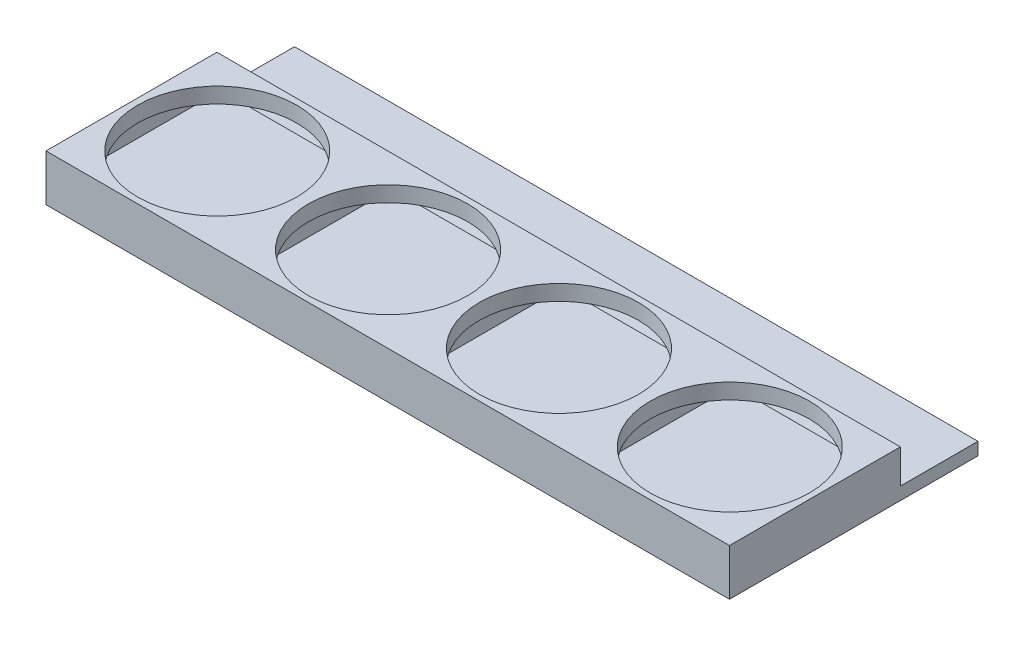
ISO-10303-21;
HEADER;
FILE_DESCRIPTION(('STEP AP214'),'2;1');
FILE_NAME('part.step','',(''),(''),'','','');
FILE_SCHEMA(('AUTOMOTIVE_DESIGN { 1 0 10303 214 1 1 1 1 }'));
ENDSEC;
DATA;
#1=APPLICATION_CONTEXT('core data for automotive mechanical design processes');
#2=APPLICATION_PROTOCOL_DEFINITION('international standard','automotive_design',2000,#1);
#3=PRODUCT_CONTEXT('',#1,'mechanical');
#4=PRODUCT('Part','Part','',(#3));
#5=PRODUCT_RELATED_PRODUCT_CATEGORY('part','',(#4));
#6=PRODUCT_DEFINITION_FORMATION('','',#4);
#7=PRODUCT_DEFINITION_CONTEXT('part definition',#1,'design');
#8=PRODUCT_DEFINITION('design','',#6,#7);
#9=PRODUCT_DEFINITION_SHAPE('','',#8);
#10=(LENGTH_UNIT() NAMED_UNIT(*) SI_UNIT(.MILLI.,.METRE.));
#11=(NAMED_UNIT(*) PLANE_ANGLE_UNIT() SI_UNIT($,.RADIAN.));
#12=(NAMED_UNIT(*) SI_UNIT($,.STERADIAN.) SOLID_ANGLE_UNIT());
#13=UNCERTAINTY_MEASURE_WITH_UNIT(LENGTH_MEASURE(1.E-05),#10,'distance_accuracy_value','');
#14=(GEOMETRIC_REPRESENTATION_CONTEXT(3) GLOBAL_UNCERTAINTY_ASSIGNED_CONTEXT((#13)) GLOBAL_UNIT_ASSIGNED_CONTEXT((#10,
#11,#12)) REPRESENTATION_CONTEXT('',''));
#15=CARTESIAN_POINT('',(0.,0.,0.));
#16=DIRECTION('',(0.,0.,1.));
#17=DIRECTION('',(1.,0.,0.));
#18=AXIS2_PLACEMENT_3D('',#15,#16,#17);
#19=CARTESIAN_POINT('',(0.,-6.,0.));
#20=DIRECTION('',(-1.,0.,0.));
#21=DIRECTION('',(0.,0.,1.));
#22=AXIS2_PLACEMENT_3D('',#19,#20,#21);
#23=PLANE('',#22);
#24=DIRECTION('',(0.,0.,1.));
#25=VECTOR('',#24,1.);
#26=CARTESIAN_POINT('',(0.,0.,0.));
#27=LINE('',#26,#25);
#28=CARTESIAN_POINT('',(0.,0.,-22.));
#29=VERTEX_POINT('',#28);
#30=CARTESIAN_POINT('',(0.,0.,0.));
#31=VERTEX_POINT('',#30);
#32=EDGE_CURVE('E372',#29,#31,#27,.T.);
#33=ORIENTED_EDGE('',*,*,#32,.F.);
#34=DIRECTION('',(0.,1.,0.));
#35=VECTOR('',#34,1.);
#36=CARTESIAN_POINT('',(0.,-6.,-22.));
#37=LINE('',#36,#35);
#38=CARTESIAN_POINT('',(0.,-4.37930067823277,-22.));
#39=VERTEX_POINT('',#38);
#40=EDGE_CURVE('E11',#39,#29,#37,.T.);
#41=ORIENTED_EDGE('',*,*,#40,.F.);
#42=DIRECTION('',(0.,0.,1.));
#43=VECTOR('',#42,1.);
#44=CARTESIAN_POINT('',(0.,-4.37930067823277,-27.));
#45=LINE('',#44,#43);
#46=CARTESIAN_POINT('',(0.,-4.37930067823277,-32.));
#47=VERTEX_POINT('',#46);
#48=EDGE_CURVE('E190',#47,#39,#45,.T.);
#49=ORIENTED_EDGE('',*,*,#48,.F.);
#50=DIRECTION('',(0.,1.,0.));
#51=VECTOR('',#50,1.);
#52=CARTESIAN_POINT('',(0.,-4.37930067823277,-32.));
#53=LINE('',#52,#51);
#54=CARTESIAN_POINT('',(0.,-6.,-32.));
#55=VERTEX_POINT('',#54);
#56=EDGE_CURVE('E205',#55,#47,#53,.T.);
#57=ORIENTED_EDGE('',*,*,#56,.F.);
#58=DIRECTION('',(0.,0.,1.));
#59=VECTOR('',#58,1.);
#60=CARTESIAN_POINT('',(0.,-6.,0.));
#61=LINE('',#60,#59);
#62=CARTESIAN_POINT('',(0.,-6.,0.));
#63=VERTEX_POINT('',#62);
#64=EDGE_CURVE('E373',#55,#63,#61,.T.);
#65=ORIENTED_EDGE('',*,*,#64,.T.);
#66=DIRECTION('',(0.,1.,0.));
#67=VECTOR('',#66,1.);
#68=CARTESIAN_POINT('',(0.,-6.,0.));
#69=LINE('',#68,#67);
#70=EDGE_CURVE('E38',#63,#31,#69,.T.);
#71=ORIENTED_EDGE('',*,*,#70,.T.);
#72=EDGE_LOOP('',(#33,#41,#49,#57,#65,#71));
#73=FACE_BOUND('',#72,.T.);
#74=ADVANCED_FACE('F35',(#73),#23,.T.);
#75=CARTESIAN_POINT('',(0.,-6.,-22.));
#76=DIRECTION('',(0.,0.,-1.));
#77=DIRECTION('',(-1.,0.,0.));
#78=AXIS2_PLACEMENT_3D('',#75,#76,#77);
#79=PLANE('',#78);
#80=DIRECTION('',(1.,0.,0.));
#81=VECTOR('',#80,1.);
#82=CARTESIAN_POINT('',(88.,-4.37930067823277,-22.));
#83=LINE('',#82,#81);
#84=CARTESIAN_POINT('',(88.,-4.37930067823277,-22.));
#85=VERTEX_POINT('',#84);
#86=EDGE_CURVE('E48',#39,#85,#83,.T.);
#87=ORIENTED_EDGE('',*,*,#86,.F.);
#88=ORIENTED_EDGE('',*,*,#40,.T.);
#89=DIRECTION('',(-1.,0.,0.));
#90=VECTOR('',#89,1.);
#91=CARTESIAN_POINT('',(0.,0.,-22.));
#92=LINE('',#91,#90);
#93=CARTESIAN_POINT('',(88.,0.,-22.));
#94=VERTEX_POINT('',#93);
#95=EDGE_CURVE('E377',#94,#29,#92,.T.);
#96=ORIENTED_EDGE('',*,*,#95,.F.);
#97=DIRECTION('',(0.,1.,0.));
#98=VECTOR('',#97,1.);
#99=CARTESIAN_POINT('',(88.,-6.,-22.));
#100=LINE('',#99,#98);
#101=EDGE_CURVE('E330',#85,#94,#100,.T.);
#102=ORIENTED_EDGE('',*,*,#101,.F.);
#103=EDGE_LOOP('',(#87,#88,#96,#102));
#104=FACE_BOUND('',#103,.T.);
#105=DIRECTION('',(0.,-1.,0.));
#106=VECTOR('',#105,1.);
#107=CARTESIAN_POINT('',(43.5,-2.,-22.));
#108=LINE('',#107,#106);
#109=CARTESIAN_POINT('',(43.5,-2.,-22.));
#110=VERTEX_POINT('',#109);
#111=CARTESIAN_POINT('',(43.5,-4.,-22.));
#112=VERTEX_POINT('',#111);
#113=EDGE_CURVE('E56',#110,#112,#108,.T.);
#114=ORIENTED_EDGE('',*,*,#113,.F.);
#115=DIRECTION('',(1.,0.,0.));
#116=VECTOR('',#115,1.);
#117=CARTESIAN_POINT('',(43.5,-2.,-22.));
#118=LINE('',#117,#116);
#119=CARTESIAN_POINT('',(22.5,-2.,-22.));
#120=VERTEX_POINT('',#119);
#121=EDGE_CURVE('E218',#120,#110,#118,.T.);
#122=ORIENTED_EDGE('',*,*,#121,.F.);
#123=DIRECTION('',(0.,1.,0.));
#124=VECTOR('',#123,1.);
#125=CARTESIAN_POINT('',(22.5,-2.,-22.));
#126=LINE('',#125,#124);
#127=CARTESIAN_POINT('',(22.5,-4.,-22.));
#128=VERTEX_POINT('',#127);
#129=EDGE_CURVE('E233',#128,#120,#126,.T.);
#130=ORIENTED_EDGE('',*,*,#129,.F.);
#131=DIRECTION('',(-1.,0.,0.));
#132=VECTOR('',#131,1.);
#133=CARTESIAN_POINT('',(43.5,-4.,-22.));
#134=LINE('',#133,#132);
#135=EDGE_CURVE('E229',#112,#128,#134,.T.);
#136=ORIENTED_EDGE('',*,*,#135,.F.);
#137=EDGE_LOOP('',(#114,#122,#130,#136));
#138=FACE_BOUND('',#137,.T.);
#139=DIRECTION('',(0.,-1.,0.));
#140=VECTOR('',#139,1.);
#141=CARTESIAN_POINT('',(65.5,-2.,-22.));
#142=LINE('',#141,#140);
#143=CARTESIAN_POINT('',(65.5,-2.,-22.));
#144=VERTEX_POINT('',#143);
#145=CARTESIAN_POINT('',(65.5,-4.,-22.));
#146=VERTEX_POINT('',#145);
#147=EDGE_CURVE('E260',#144,#146,#142,.T.);
#148=ORIENTED_EDGE('',*,*,#147,.F.);
#149=DIRECTION('',(1.,0.,0.));
#150=VECTOR('',#149,1.);
#151=CARTESIAN_POINT('',(65.5,-2.,-22.));
#152=LINE('',#151,#150);
#153=CARTESIAN_POINT('',(44.5,-2.,-22.));
#154=VERTEX_POINT('',#153);
#155=EDGE_CURVE('E250',#154,#144,#152,.T.);
#156=ORIENTED_EDGE('',*,*,#155,.F.);
#157=DIRECTION('',(0.,1.,0.));
#158=VECTOR('',#157,1.);
#159=CARTESIAN_POINT('',(44.5,-2.,-22.));
#160=LINE('',#159,#158);
#161=CARTESIAN_POINT('',(44.5,-4.,-22.));
#162=VERTEX_POINT('',#161);
#163=EDGE_CURVE('E266',#162,#154,#160,.T.);
#164=ORIENTED_EDGE('',*,*,#163,.F.);
#165=DIRECTION('',(-1.,0.,0.));
#166=VECTOR('',#165,1.);
#167=CARTESIAN_POINT('',(65.5,-4.,-22.));
#168=LINE('',#167,#166);
#169=EDGE_CURVE('E262',#146,#162,#168,.T.);
#170=ORIENTED_EDGE('',*,*,#169,.F.);
#171=EDGE_LOOP('',(#148,#156,#164,#170));
#172=FACE_BOUND('',#171,.T.);
#173=DIRECTION('',(0.,-1.,0.));
#174=VECTOR('',#173,1.);
#175=CARTESIAN_POINT('',(87.5,-2.,-22.));
#176=LINE('',#175,#174);
#177=CARTESIAN_POINT('',(87.5,-2.,-22.));
#178=VERTEX_POINT('',#177);
#179=CARTESIAN_POINT('',(87.5,-4.,-22.));
#180=VERTEX_POINT('',#179);
#181=EDGE_CURVE('E213',#178,#180,#176,.T.);
#182=ORIENTED_EDGE('',*,*,#181,.F.);
#183=DIRECTION('',(1.,0.,0.));
#184=VECTOR('',#183,1.);
#185=CARTESIAN_POINT('',(87.5,-2.,-22.));
#186=LINE('',#185,#184);
#187=CARTESIAN_POINT('',(66.5,-2.,-22.));
#188=VERTEX_POINT('',#187);
#189=EDGE_CURVE('E282',#188,#178,#186,.T.);
#190=ORIENTED_EDGE('',*,*,#189,.F.);
#191=DIRECTION('',(0.,1.,0.));
#192=VECTOR('',#191,1.);
#193=CARTESIAN_POINT('',(66.5,-2.,-22.));
#194=LINE('',#193,#192);
#195=CARTESIAN_POINT('',(66.5,-4.,-22.));
#196=VERTEX_POINT('',#195);
#197=EDGE_CURVE('E296',#196,#188,#194,.T.);
#198=ORIENTED_EDGE('',*,*,#197,.F.);
#199=DIRECTION('',(-1.,0.,0.));
#200=VECTOR('',#199,1.);
#201=CARTESIAN_POINT('',(87.5,-4.,-22.));
#202=LINE('',#201,#200);
#203=EDGE_CURVE('E293',#180,#196,#202,.T.);
#204=ORIENTED_EDGE('',*,*,#203,.F.);
#205=EDGE_LOOP('',(#182,#190,#198,#204));
#206=FACE_BOUND('',#205,.T.);
#207=DIRECTION('',(0.,-1.,0.));
#208=VECTOR('',#207,1.);
#209=CARTESIAN_POINT('',(21.5,-2.,-22.));
#210=LINE('',#209,#208);
#211=CARTESIAN_POINT('',(21.5,-2.,-22.));
#212=VERTEX_POINT('',#211);
#213=CARTESIAN_POINT('',(21.5,-4.,-22.));
#214=VERTEX_POINT('',#213);
#215=EDGE_CURVE('E332',#212,#214,#210,.T.);
#216=ORIENTED_EDGE('',*,*,#215,.F.);
#217=DIRECTION('',(1.,0.,0.));
#218=VECTOR('',#217,1.);
#219=CARTESIAN_POINT('',(21.5,-2.,-22.));
#220=LINE('',#219,#218);
#221=CARTESIAN_POINT('',(0.499999999999997,-2.,-22.));
#222=VERTEX_POINT('',#221);
#223=EDGE_CURVE('E339',#222,#212,#220,.T.);
#224=ORIENTED_EDGE('',*,*,#223,.F.);
#225=DIRECTION('',(0.,1.,0.));
#226=VECTOR('',#225,1.);
#227=CARTESIAN_POINT('',(0.499999999999997,-2.,-22.));
#228=LINE('',#227,#226);
#229=CARTESIAN_POINT('',(0.499999999999997,-4.,-22.));
#230=VERTEX_POINT('',#229);
#231=EDGE_CURVE('E353',#230,#222,#228,.T.);
#232=ORIENTED_EDGE('',*,*,#231,.F.);
#233=DIRECTION('',(-1.,0.,0.));
#234=VECTOR('',#233,1.);
#235=CARTESIAN_POINT('',(21.5,-4.,-22.));
#236=LINE('',#235,#234);
#237=EDGE_CURVE('E350',#214,#230,#236,.T.);
#238=ORIENTED_EDGE('',*,*,#237,.F.);
#239=EDGE_LOOP('',(#216,#224,#232,#238));
#240=FACE_BOUND('',#239,.T.);
#241=ADVANCED_FACE('F388',(#104,#138,#172,#206,#240),#79,.T.);
#242=CARTESIAN_POINT('',(0.,-6.,0.));
#243=DIRECTION('',(0.,0.,1.));
#244=DIRECTION('',(1.,0.,0.));
#245=AXIS2_PLACEMENT_3D('',#242,#243,#244);
#246=PLANE('',#245);
#247=DIRECTION('',(1.,0.,0.));
#248=VECTOR('',#247,1.);
#249=CARTESIAN_POINT('',(0.,0.,0.));
#250=LINE('',#249,#248);
#251=CARTESIAN_POINT('',(88.,0.,0.));
#252=VERTEX_POINT('',#251);
#253=EDGE_CURVE('E381',#31,#252,#250,.T.);
#254=ORIENTED_EDGE('',*,*,#253,.F.);
#255=ORIENTED_EDGE('',*,*,#70,.F.);
#256=DIRECTION('',(1.,0.,0.));
#257=VECTOR('',#256,1.);
#258=CARTESIAN_POINT('',(0.,-6.,0.));
#259=LINE('',#258,#257);
#260=CARTESIAN_POINT('',(88.,-6.,0.));
#261=VERTEX_POINT('',#260);
#262=EDGE_CURVE('E376',#63,#261,#259,.T.);
#263=ORIENTED_EDGE('',*,*,#262,.T.);
#264=DIRECTION('',(0.,1.,0.));
#265=VECTOR('',#264,1.);
#266=CARTESIAN_POINT('',(88.,-6.,0.));
#267=LINE('',#266,#265);
#268=EDGE_CURVE('E327',#261,#252,#267,.T.);
#269=ORIENTED_EDGE('',*,*,#268,.T.);
#270=EDGE_LOOP('',(#254,#255,#263,#269));
#271=FACE_BOUND('',#270,.T.);
#272=ADVANCED_FACE('F394',(#271),#246,.T.);
#273=CARTESIAN_POINT('',(0.,-6.,0.));
#274=DIRECTION('',(0.,-1.,0.));
#275=DIRECTION('',(0.,0.,-1.));
#276=AXIS2_PLACEMENT_3D('',#273,#274,#275);
#277=PLANE('',#276);
#278=ORIENTED_EDGE('',*,*,#64,.F.);
#279=DIRECTION('',(-1.,0.,0.));
#280=VECTOR('',#279,1.);
#281=CARTESIAN_POINT('',(88.,-6.,-32.));
#282=LINE('',#281,#280);
#283=CARTESIAN_POINT('',(88.,-6.,-32.));
#284=VERTEX_POINT('',#283);
#285=EDGE_CURVE('E207',#284,#55,#282,.T.);
#286=ORIENTED_EDGE('',*,*,#285,.F.);
#287=DIRECTION('',(0.,0.,-1.));
#288=VECTOR('',#287,1.);
#289=CARTESIAN_POINT('',(88.,-6.,0.));
#290=LINE('',#289,#288);
#291=EDGE_CURVE('E198',#261,#284,#290,.T.);
#292=ORIENTED_EDGE('',*,*,#291,.F.);
#293=ORIENTED_EDGE('',*,*,#262,.F.);
#294=EDGE_LOOP('',(#278,#286,#292,#293));
#295=FACE_BOUND('',#294,.T.);
#296=ADVANCED_FACE('F396',(#295),#277,.T.);
#297=CARTESIAN_POINT('',(0.,0.,0.));
#298=DIRECTION('',(0.,-1.,0.));
#299=DIRECTION('',(0.,0.,-1.));
#300=AXIS2_PLACEMENT_3D('',#297,#298,#299);
#301=PLANE('',#300);
#302=CARTESIAN_POINT('',(33.0440730910435,0.,-11.));
#303=DIRECTION('',(0.,1.,0.));
#304=DIRECTION('',(0.,0.,1.));
#305=AXIS2_PLACEMENT_3D('',#302,#303,#304);
#306=CIRCLE('',#305,10.25);
#307=CARTESIAN_POINT('',(33.0440730910435,0.,-0.750000000000006));
#308=VERTEX_POINT('',#307);
#309=EDGE_CURVE('E313',#308,#308,#306,.T.);
#310=ORIENTED_EDGE('',*,*,#309,.F.);
#311=EDGE_LOOP('',(#310));
#312=FACE_BOUND('',#311,.T.);
#313=CARTESIAN_POINT('',(55.0440730910435,0.,-11.));
#314=DIRECTION('',(0.,1.,0.));
#315=DIRECTION('',(0.,0.,1.));
#316=AXIS2_PLACEMENT_3D('',#313,#314,#315);
#317=CIRCLE('',#316,10.25);
#318=CARTESIAN_POINT('',(55.0440730910435,0.,-0.750000000000013));
#319=VERTEX_POINT('',#318);
#320=EDGE_CURVE('E317',#319,#319,#317,.T.);
#321=ORIENTED_EDGE('',*,*,#320,.F.);
#322=EDGE_LOOP('',(#321));
#323=FACE_BOUND('',#322,.T.);
#324=CARTESIAN_POINT('',(77.0440730910435,0.,-11.));
#325=DIRECTION('',(0.,1.,0.));
#326=DIRECTION('',(0.,0.,1.));
#327=AXIS2_PLACEMENT_3D('',#324,#325,#326);
#328=CIRCLE('',#327,10.25);
#329=CARTESIAN_POINT('',(77.0440730910435,0.,-0.75000000000002));
#330=VERTEX_POINT('',#329);
#331=EDGE_CURVE('E311',#330,#330,#328,.T.);
#332=ORIENTED_EDGE('',*,*,#331,.F.);
#333=EDGE_LOOP('',(#332));
#334=FACE_BOUND('',#333,.T.);
#335=CARTESIAN_POINT('',(11.0440730910435,0.,-11.));
#336=DIRECTION('',(0.,1.,0.));
#337=DIRECTION('',(0.,0.,1.));
#338=AXIS2_PLACEMENT_3D('',#335,#336,#337);
#339=CIRCLE('',#338,10.25);
#340=CARTESIAN_POINT('',(11.0440730910435,0.,-0.749999999999999));
#341=VERTEX_POINT('',#340);
#342=EDGE_CURVE('E369',#341,#341,#339,.T.);
#343=ORIENTED_EDGE('',*,*,#342,.F.);
#344=EDGE_LOOP('',(#343));
#345=FACE_BOUND('',#344,.T.);
#346=ORIENTED_EDGE('',*,*,#32,.T.);
#347=ORIENTED_EDGE('',*,*,#253,.T.);
#348=DIRECTION('',(0.,0.,-1.));
#349=VECTOR('',#348,1.);
#350=CARTESIAN_POINT('',(88.,0.,0.));
#351=LINE('',#350,#349);
#352=EDGE_CURVE('E316',#252,#94,#351,.T.);
#353=ORIENTED_EDGE('',*,*,#352,.T.);
#354=ORIENTED_EDGE('',*,*,#95,.T.);
#355=EDGE_LOOP('',(#346,#347,#353,#354));
#356=FACE_BOUND('',#355,.T.);
#357=ADVANCED_FACE('F386',(#312,#323,#334,#345,#356),#301,.F.);
#358=CARTESIAN_POINT('',(11.0440730910435,-2.,-11.));
#359=DIRECTION('',(0.,1.,0.));
#360=DIRECTION('',(0.,0.,1.));
#361=AXIS2_PLACEMENT_3D('',#358,#359,#360);
#362=CYLINDRICAL_SURFACE('',#361,10.25);
#363=CARTESIAN_POINT('',(11.0440730910435,-2.,-11.));
#364=DIRECTION('',(0.,1.,0.));
#365=DIRECTION('',(0.,0.,1.));
#366=AXIS2_PLACEMENT_3D('',#363,#364,#365);
#367=CIRCLE('',#366,10.25);
#368=CARTESIAN_POINT('',(11.0440730910435,-2.,-0.749999999999999));
#369=VERTEX_POINT('',#368);
#370=EDGE_CURVE('E360',#369,#369,#367,.T.);
#371=ORIENTED_EDGE('',*,*,#370,.F.);
#372=EDGE_LOOP('',(#371));
#373=FACE_BOUND('',#372,.T.);
#374=ORIENTED_EDGE('',*,*,#342,.T.);
#375=EDGE_LOOP('',(#374));
#376=FACE_BOUND('',#375,.T.);
#377=ADVANCED_FACE('F403',(#373,#376),#362,.F.);
#378=CARTESIAN_POINT('',(21.5,-2.,-0.5));
#379=DIRECTION('',(1.,0.,0.));
#380=DIRECTION('',(0.,0.,-1.));
#381=AXIS2_PLACEMENT_3D('',#378,#379,#380);
#382=PLANE('',#381);
#383=ORIENTED_EDGE('',*,*,#215,.T.);
#384=DIRECTION('',(0.,0.,-1.));
#385=VECTOR('',#384,1.);
#386=CARTESIAN_POINT('',(21.5,-4.,-0.5));
#387=LINE('',#386,#385);
#388=CARTESIAN_POINT('',(21.5,-4.,-0.5));
#389=VERTEX_POINT('',#388);
#390=EDGE_CURVE('E348',#389,#214,#387,.T.);
#391=ORIENTED_EDGE('',*,*,#390,.F.);
#392=DIRECTION('',(0.,-1.,0.));
#393=VECTOR('',#392,1.);
#394=CARTESIAN_POINT('',(21.5,-2.,-0.5));
#395=LINE('',#394,#393);
#396=CARTESIAN_POINT('',(21.5,-2.,-0.5));
#397=VERTEX_POINT('',#396);
#398=EDGE_CURVE('E335',#397,#389,#395,.T.);
#399=ORIENTED_EDGE('',*,*,#398,.F.);
#400=DIRECTION('',(0.,0.,-1.));
#401=VECTOR('',#400,1.);
#402=CARTESIAN_POINT('',(21.5,-2.,-0.5));
#403=LINE('',#402,#401);
#404=EDGE_CURVE('E358',#397,#212,#403,.T.);
#405=ORIENTED_EDGE('',*,*,#404,.T.);
#406=EDGE_LOOP('',(#383,#391,#399,#405));
#407=FACE_BOUND('',#406,.T.);
#408=ADVANCED_FACE('F683',(#407),#382,.F.);
#409=CARTESIAN_POINT('',(21.5,-2.,-0.5));
#410=DIRECTION('',(0.,1.,0.));
#411=DIRECTION('',(-1.,0.,0.));
#412=AXIS2_PLACEMENT_3D('',#409,#410,#411);
#413=PLANE('',#412);
#414=ORIENTED_EDGE('',*,*,#370,.T.);
#415=EDGE_LOOP('',(#414));
#416=FACE_BOUND('',#415,.T.);
#417=ORIENTED_EDGE('',*,*,#223,.T.);
#418=ORIENTED_EDGE('',*,*,#404,.F.);
#419=DIRECTION('',(1.,0.,0.));
#420=VECTOR('',#419,1.);
#421=CARTESIAN_POINT('',(21.5,-2.,-0.5));
#422=LINE('',#421,#420);
#423=CARTESIAN_POINT('',(0.499999999999997,-2.,-0.5));
#424=VERTEX_POINT('',#423);
#425=EDGE_CURVE('E345',#424,#397,#422,.T.);
#426=ORIENTED_EDGE('',*,*,#425,.F.);
#427=DIRECTION('',(0.,0.,-1.));
#428=VECTOR('',#427,1.);
#429=CARTESIAN_POINT('',(0.499999999999997,-2.,-0.5));
#430=LINE('',#429,#428);
#431=EDGE_CURVE('E361',#424,#222,#430,.T.);
#432=ORIENTED_EDGE('',*,*,#431,.T.);
#433=EDGE_LOOP('',(#417,#418,#426,#432));
#434=FACE_BOUND('',#433,.T.);
#435=ADVANCED_FACE('F691',(#416,#434),#413,.F.);
#436=CARTESIAN_POINT('',(0.499999999999997,-2.,-0.5));
#437=DIRECTION('',(-1.,0.,0.));
#438=DIRECTION('',(0.,-1.,0.));
#439=AXIS2_PLACEMENT_3D('',#436,#437,#438);
#440=PLANE('',#439);
#441=ORIENTED_EDGE('',*,*,#231,.T.);
#442=ORIENTED_EDGE('',*,*,#431,.F.);
#443=DIRECTION('',(0.,1.,0.));
#444=VECTOR('',#443,1.);
#445=CARTESIAN_POINT('',(0.499999999999997,-2.,-0.5));
#446=LINE('',#445,#444);
#447=CARTESIAN_POINT('',(0.499999999999997,-4.,-0.5));
#448=VERTEX_POINT('',#447);
#449=EDGE_CURVE('E342',#448,#424,#446,.T.);
#450=ORIENTED_EDGE('',*,*,#449,.F.);
#451=DIRECTION('',(0.,0.,-1.));
#452=VECTOR('',#451,1.);
#453=CARTESIAN_POINT('',(0.499999999999997,-4.,-0.5));
#454=LINE('',#453,#452);
#455=EDGE_CURVE('E363',#448,#230,#454,.T.);
#456=ORIENTED_EDGE('',*,*,#455,.T.);
#457=EDGE_LOOP('',(#441,#442,#450,#456));
#458=FACE_BOUND('',#457,.T.);
#459=ADVANCED_FACE('F700',(#458),#440,.F.);
#460=CARTESIAN_POINT('',(21.5,-4.,-0.5));
#461=DIRECTION('',(0.,-1.,0.));
#462=DIRECTION('',(1.,0.,0.));
#463=AXIS2_PLACEMENT_3D('',#460,#461,#462);
#464=PLANE('',#463);
#465=ORIENTED_EDGE('',*,*,#237,.T.);
#466=ORIENTED_EDGE('',*,*,#455,.F.);
#467=DIRECTION('',(-1.,0.,0.));
#468=VECTOR('',#467,1.);
#469=CARTESIAN_POINT('',(21.5,-4.,-0.5));
#470=LINE('',#469,#468);
#471=EDGE_CURVE('E338',#389,#448,#470,.T.);
#472=ORIENTED_EDGE('',*,*,#471,.F.);
#473=ORIENTED_EDGE('',*,*,#390,.T.);
#474=EDGE_LOOP('',(#465,#466,#472,#473));
#475=FACE_BOUND('',#474,.T.);
#476=ADVANCED_FACE('F709',(#475),#464,.F.);
#477=CARTESIAN_POINT('',(0.,0.,-0.5));
#478=DIRECTION('',(0.,0.,-1.));
#479=DIRECTION('',(-1.,0.,0.));
#480=AXIS2_PLACEMENT_3D('',#477,#478,#479);
#481=PLANE('',#480);
#482=ORIENTED_EDGE('',*,*,#398,.T.);
#483=ORIENTED_EDGE('',*,*,#471,.T.);
#484=ORIENTED_EDGE('',*,*,#449,.T.);
#485=ORIENTED_EDGE('',*,*,#425,.T.);
#486=EDGE_LOOP('',(#482,#483,#484,#485));
#487=FACE_BOUND('',#486,.T.);
#488=ADVANCED_FACE('F427',(#487),#481,.T.);
#489=CARTESIAN_POINT('',(88.,-6.,0.));
#490=DIRECTION('',(1.,0.,0.));
#491=DIRECTION('',(0.,0.,-1.));
#492=AXIS2_PLACEMENT_3D('',#489,#490,#491);
#493=PLANE('',#492);
#494=ORIENTED_EDGE('',*,*,#352,.F.);
#495=ORIENTED_EDGE('',*,*,#268,.F.);
#496=ORIENTED_EDGE('',*,*,#291,.T.);
#497=DIRECTION('',(0.,-1.,0.));
#498=VECTOR('',#497,1.);
#499=CARTESIAN_POINT('',(88.,-4.37930067823277,-32.));
#500=LINE('',#499,#498);
#501=CARTESIAN_POINT('',(88.,-4.37930067823277,-32.));
#502=VERTEX_POINT('',#501);
#503=EDGE_CURVE('E193',#502,#284,#500,.T.);
#504=ORIENTED_EDGE('',*,*,#503,.F.);
#505=DIRECTION('',(0.,0.,1.));
#506=VECTOR('',#505,1.);
#507=CARTESIAN_POINT('',(88.,-4.37930067823277,-27.));
#508=LINE('',#507,#506);
#509=EDGE_CURVE('E182',#502,#85,#508,.T.);
#510=ORIENTED_EDGE('',*,*,#509,.T.);
#511=ORIENTED_EDGE('',*,*,#101,.T.);
#512=EDGE_LOOP('',(#494,#495,#496,#504,#510,#511));
#513=FACE_BOUND('',#512,.T.);
#514=ADVANCED_FACE('F195',(#513),#493,.T.);
#515=CARTESIAN_POINT('',(77.0440730910435,-2.,-11.));
#516=DIRECTION('',(0.,1.,0.));
#517=DIRECTION('',(0.,0.,1.));
#518=AXIS2_PLACEMENT_3D('',#515,#516,#517);
#519=CYLINDRICAL_SURFACE('',#518,10.25);
#520=CARTESIAN_POINT('',(77.0440730910435,-2.,-11.));
#521=DIRECTION('',(0.,1.,0.));
#522=DIRECTION('',(0.,0.,1.));
#523=AXIS2_PLACEMENT_3D('',#520,#521,#522);
#524=CIRCLE('',#523,10.25);
#525=CARTESIAN_POINT('',(77.0440730910435,-2.,-0.75000000000002));
#526=VERTEX_POINT('',#525);
#527=EDGE_CURVE('E240',#526,#526,#524,.T.);
#528=ORIENTED_EDGE('',*,*,#527,.F.);
#529=EDGE_LOOP('',(#528));
#530=FACE_BOUND('',#529,.T.);
#531=ORIENTED_EDGE('',*,*,#331,.T.);
#532=EDGE_LOOP('',(#531));
#533=FACE_BOUND('',#532,.T.);
#534=ADVANCED_FACE('F441',(#530,#533),#519,.F.);
#535=CARTESIAN_POINT('',(55.0440730910435,-2.,-11.));
#536=DIRECTION('',(0.,1.,0.));
#537=DIRECTION('',(0.,0.,1.));
#538=AXIS2_PLACEMENT_3D('',#535,#536,#537);
#539=CYLINDRICAL_SURFACE('',#538,10.25);
#540=CARTESIAN_POINT('',(55.0440730910435,-2.,-11.));
#541=DIRECTION('',(0.,1.,0.));
#542=DIRECTION('',(0.,0.,1.));
#543=AXIS2_PLACEMENT_3D('',#540,#541,#542);
#544=CIRCLE('',#543,10.25);
#545=CARTESIAN_POINT('',(55.0440730910435,-2.,-0.750000000000013));
#546=VERTEX_POINT('',#545);
#547=EDGE_CURVE('E312',#546,#546,#544,.T.);
#548=ORIENTED_EDGE('',*,*,#547,.F.);
#549=EDGE_LOOP('',(#548));
#550=FACE_BOUND('',#549,.T.);
#551=ORIENTED_EDGE('',*,*,#320,.T.);
#552=EDGE_LOOP('',(#551));
#553=FACE_BOUND('',#552,.T.);
#554=ADVANCED_FACE('F446',(#550,#553),#539,.F.);
#555=CARTESIAN_POINT('',(33.0440730910435,-2.,-11.));
#556=DIRECTION('',(0.,1.,0.));
#557=DIRECTION('',(0.,0.,1.));
#558=AXIS2_PLACEMENT_3D('',#555,#556,#557);
#559=CYLINDRICAL_SURFACE('',#558,10.25);
#560=CARTESIAN_POINT('',(33.0440730910435,-2.,-11.));
#561=DIRECTION('',(0.,1.,0.));
#562=DIRECTION('',(0.,0.,1.));
#563=AXIS2_PLACEMENT_3D('',#560,#561,#562);
#564=CIRCLE('',#563,10.25);
#565=CARTESIAN_POINT('',(33.0440730910435,-2.,-0.750000000000006));
#566=VERTEX_POINT('',#565);
#567=EDGE_CURVE('E308',#566,#566,#564,.T.);
#568=ORIENTED_EDGE('',*,*,#567,.F.);
#569=EDGE_LOOP('',(#568));
#570=FACE_BOUND('',#569,.T.);
#571=ORIENTED_EDGE('',*,*,#309,.T.);
#572=EDGE_LOOP('',(#571));
#573=FACE_BOUND('',#572,.T.);
#574=ADVANCED_FACE('F457',(#570,#573),#559,.F.);
#575=CARTESIAN_POINT('',(87.5,-2.,-0.500000000000021));
#576=DIRECTION('',(1.,0.,0.));
#577=DIRECTION('',(0.,0.,-1.));
#578=AXIS2_PLACEMENT_3D('',#575,#576,#577);
#579=PLANE('',#578);
#580=ORIENTED_EDGE('',*,*,#181,.T.);
#581=DIRECTION('',(0.,0.,-1.));
#582=VECTOR('',#581,1.);
#583=CARTESIAN_POINT('',(87.5,-4.,-0.500000000000021));
#584=LINE('',#583,#582);
#585=CARTESIAN_POINT('',(87.5,-4.,-0.500000000000021));
#586=VERTEX_POINT('',#585);
#587=EDGE_CURVE('E291',#586,#180,#584,.T.);
#588=ORIENTED_EDGE('',*,*,#587,.F.);
#589=DIRECTION('',(0.,-1.,0.));
#590=VECTOR('',#589,1.);
#591=CARTESIAN_POINT('',(87.5,-2.,-0.500000000000021));
#592=LINE('',#591,#590);
#593=CARTESIAN_POINT('',(87.5,-2.,-0.500000000000021));
#594=VERTEX_POINT('',#593);
#595=EDGE_CURVE('E278',#594,#586,#592,.T.);
#596=ORIENTED_EDGE('',*,*,#595,.F.);
#597=DIRECTION('',(0.,0.,-1.));
#598=VECTOR('',#597,1.);
#599=CARTESIAN_POINT('',(87.5,-2.,-0.500000000000021));
#600=LINE('',#599,#598);
#601=EDGE_CURVE('E263',#594,#178,#600,.T.);
#602=ORIENTED_EDGE('',*,*,#601,.T.);
#603=EDGE_LOOP('',(#580,#588,#596,#602));
#604=FACE_BOUND('',#603,.T.);
#605=ADVANCED_FACE('F467',(#604),#579,.F.);
#606=CARTESIAN_POINT('',(87.5,-2.,-0.500000000000021));
#607=DIRECTION('',(0.,1.,0.));
#608=DIRECTION('',(-1.,0.,0.));
#609=AXIS2_PLACEMENT_3D('',#606,#607,#608);
#610=PLANE('',#609);
#611=ORIENTED_EDGE('',*,*,#527,.T.);
#612=EDGE_LOOP('',(#611));
#613=FACE_BOUND('',#612,.T.);
#614=ORIENTED_EDGE('',*,*,#189,.T.);
#615=ORIENTED_EDGE('',*,*,#601,.F.);
#616=DIRECTION('',(1.,0.,0.));
#617=VECTOR('',#616,1.);
#618=CARTESIAN_POINT('',(87.5,-2.,-0.500000000000021));
#619=LINE('',#618,#617);
#620=CARTESIAN_POINT('',(66.5,-2.,-0.500000000000021));
#621=VERTEX_POINT('',#620);
#622=EDGE_CURVE('E288',#621,#594,#619,.T.);
#623=ORIENTED_EDGE('',*,*,#622,.F.);
#624=DIRECTION('',(0.,0.,-1.));
#625=VECTOR('',#624,1.);
#626=CARTESIAN_POINT('',(66.5,-2.,-0.500000000000021));
#627=LINE('',#626,#625);
#628=EDGE_CURVE('E302',#621,#188,#627,.T.);
#629=ORIENTED_EDGE('',*,*,#628,.T.);
#630=EDGE_LOOP('',(#614,#615,#623,#629));
#631=FACE_BOUND('',#630,.T.);
#632=ADVANCED_FACE('F477',(#613,#631),#610,.F.);
#633=CARTESIAN_POINT('',(66.5,-2.,-0.500000000000021));
#634=DIRECTION('',(-1.,0.,0.));
#635=DIRECTION('',(0.,-1.,0.));
#636=AXIS2_PLACEMENT_3D('',#633,#634,#635);
#637=PLANE('',#636);
#638=ORIENTED_EDGE('',*,*,#197,.T.);
#639=ORIENTED_EDGE('',*,*,#628,.F.);
#640=DIRECTION('',(0.,1.,0.));
#641=VECTOR('',#640,1.);
#642=CARTESIAN_POINT('',(66.5,-2.,-0.500000000000021));
#643=LINE('',#642,#641);
#644=CARTESIAN_POINT('',(66.5,-4.,-0.500000000000021));
#645=VERTEX_POINT('',#644);
#646=EDGE_CURVE('E285',#645,#621,#643,.T.);
#647=ORIENTED_EDGE('',*,*,#646,.F.);
#648=DIRECTION('',(0.,0.,-1.));
#649=VECTOR('',#648,1.);
#650=CARTESIAN_POINT('',(66.5,-4.,-0.500000000000021));
#651=LINE('',#650,#649);
#652=EDGE_CURVE('E304',#645,#196,#651,.T.);
#653=ORIENTED_EDGE('',*,*,#652,.T.);
#654=EDGE_LOOP('',(#638,#639,#647,#653));
#655=FACE_BOUND('',#654,.T.);
#656=ADVANCED_FACE('F487',(#655),#637,.F.);
#657=CARTESIAN_POINT('',(87.5,-4.,-0.500000000000021));
#658=DIRECTION('',(0.,-1.,0.));
#659=DIRECTION('',(1.,0.,0.));
#660=AXIS2_PLACEMENT_3D('',#657,#658,#659);
#661=PLANE('',#660);
#662=ORIENTED_EDGE('',*,*,#203,.T.);
#663=ORIENTED_EDGE('',*,*,#652,.F.);
#664=DIRECTION('',(-1.,0.,0.));
#665=VECTOR('',#664,1.);
#666=CARTESIAN_POINT('',(87.5,-4.,-0.500000000000021));
#667=LINE('',#666,#665);
#668=EDGE_CURVE('E281',#586,#645,#667,.T.);
#669=ORIENTED_EDGE('',*,*,#668,.F.);
#670=ORIENTED_EDGE('',*,*,#587,.T.);
#671=EDGE_LOOP('',(#662,#663,#669,#670));
#672=FACE_BOUND('',#671,.T.);
#673=ADVANCED_FACE('F497',(#672),#661,.F.);
#674=CARTESIAN_POINT('',(66.,0.,-0.500000000000021));
#675=DIRECTION('',(0.,0.,-1.));
#676=DIRECTION('',(-1.,0.,0.));
#677=AXIS2_PLACEMENT_3D('',#674,#675,#676);
#678=PLANE('',#677);
#679=ORIENTED_EDGE('',*,*,#595,.T.);
#680=ORIENTED_EDGE('',*,*,#668,.T.);
#681=ORIENTED_EDGE('',*,*,#646,.T.);
#682=ORIENTED_EDGE('',*,*,#622,.T.);
#683=EDGE_LOOP('',(#679,#680,#681,#682));
#684=FACE_BOUND('',#683,.T.);
#685=ADVANCED_FACE('F507',(#684),#678,.T.);
#686=CARTESIAN_POINT('',(65.5,-2.,-0.500000000000014));
#687=DIRECTION('',(1.,0.,0.));
#688=DIRECTION('',(0.,0.,-1.));
#689=AXIS2_PLACEMENT_3D('',#686,#687,#688);
#690=PLANE('',#689);
#691=ORIENTED_EDGE('',*,*,#147,.T.);
#692=DIRECTION('',(0.,0.,-1.));
#693=VECTOR('',#692,1.);
#694=CARTESIAN_POINT('',(65.5,-4.,-0.500000000000014));
#695=LINE('',#694,#693);
#696=CARTESIAN_POINT('',(65.5,-4.,-0.500000000000014));
#697=VERTEX_POINT('',#696);
#698=EDGE_CURVE('E259',#697,#146,#695,.T.);
#699=ORIENTED_EDGE('',*,*,#698,.F.);
#700=DIRECTION('',(0.,-1.,0.));
#701=VECTOR('',#700,1.);
#702=CARTESIAN_POINT('',(65.5,-2.,-0.500000000000014));
#703=LINE('',#702,#701);
#704=CARTESIAN_POINT('',(65.5,-2.,-0.500000000000014));
#705=VERTEX_POINT('',#704);
#706=EDGE_CURVE('E246',#705,#697,#703,.T.);
#707=ORIENTED_EDGE('',*,*,#706,.F.);
#708=DIRECTION('',(0.,0.,-1.));
#709=VECTOR('',#708,1.);
#710=CARTESIAN_POINT('',(65.5,-2.,-0.500000000000014));
#711=LINE('',#710,#709);
#712=EDGE_CURVE('E230',#705,#144,#711,.T.);
#713=ORIENTED_EDGE('',*,*,#712,.T.);
#714=EDGE_LOOP('',(#691,#699,#707,#713));
#715=FACE_BOUND('',#714,.T.);
#716=ADVANCED_FACE('F517',(#715),#690,.F.);
#717=CARTESIAN_POINT('',(65.5,-2.,-0.500000000000014));
#718=DIRECTION('',(0.,1.,0.));
#719=DIRECTION('',(-1.,0.,0.));
#720=AXIS2_PLACEMENT_3D('',#717,#718,#719);
#721=PLANE('',#720);
#722=ORIENTED_EDGE('',*,*,#547,.T.);
#723=EDGE_LOOP('',(#722));
#724=FACE_BOUND('',#723,.T.);
#725=ORIENTED_EDGE('',*,*,#155,.T.);
#726=ORIENTED_EDGE('',*,*,#712,.F.);
#727=DIRECTION('',(1.,0.,0.));
#728=VECTOR('',#727,1.);
#729=CARTESIAN_POINT('',(65.5,-2.,-0.500000000000014));
#730=LINE('',#729,#728);
#731=CARTESIAN_POINT('',(44.5,-2.,-0.500000000000014));
#732=VERTEX_POINT('',#731);
#733=EDGE_CURVE('E256',#732,#705,#730,.T.);
#734=ORIENTED_EDGE('',*,*,#733,.F.);
#735=DIRECTION('',(0.,0.,-1.));
#736=VECTOR('',#735,1.);
#737=CARTESIAN_POINT('',(44.5,-2.,-0.500000000000014));
#738=LINE('',#737,#736);
#739=EDGE_CURVE('E272',#732,#154,#738,.T.);
#740=ORIENTED_EDGE('',*,*,#739,.T.);
#741=EDGE_LOOP('',(#725,#726,#734,#740));
#742=FACE_BOUND('',#741,.T.);
#743=ADVANCED_FACE('F527',(#724,#742),#721,.F.);
#744=CARTESIAN_POINT('',(44.5,-2.,-0.500000000000014));
#745=DIRECTION('',(-1.,0.,0.));
#746=DIRECTION('',(0.,-1.,0.));
#747=AXIS2_PLACEMENT_3D('',#744,#745,#746);
#748=PLANE('',#747);
#749=ORIENTED_EDGE('',*,*,#163,.T.);
#750=ORIENTED_EDGE('',*,*,#739,.F.);
#751=DIRECTION('',(0.,1.,0.));
#752=VECTOR('',#751,1.);
#753=CARTESIAN_POINT('',(44.5,-2.,-0.500000000000014));
#754=LINE('',#753,#752);
#755=CARTESIAN_POINT('',(44.5,-4.,-0.500000000000014));
#756=VERTEX_POINT('',#755);
#757=EDGE_CURVE('E253',#756,#732,#754,.T.);
#758=ORIENTED_EDGE('',*,*,#757,.F.);
#759=DIRECTION('',(0.,0.,-1.));
#760=VECTOR('',#759,1.);
#761=CARTESIAN_POINT('',(44.5,-4.,-0.500000000000014));
#762=LINE('',#761,#760);
#763=EDGE_CURVE('E274',#756,#162,#762,.T.);
#764=ORIENTED_EDGE('',*,*,#763,.T.);
#765=EDGE_LOOP('',(#749,#750,#758,#764));
#766=FACE_BOUND('',#765,.T.);
#767=ADVANCED_FACE('F537',(#766),#748,.F.);
#768=CARTESIAN_POINT('',(65.5,-4.,-0.500000000000014));
#769=DIRECTION('',(0.,-1.,0.));
#770=DIRECTION('',(1.,0.,0.));
#771=AXIS2_PLACEMENT_3D('',#768,#769,#770);
#772=PLANE('',#771);
#773=ORIENTED_EDGE('',*,*,#169,.T.);
#774=ORIENTED_EDGE('',*,*,#763,.F.);
#775=DIRECTION('',(-1.,0.,0.));
#776=VECTOR('',#775,1.);
#777=CARTESIAN_POINT('',(65.5,-4.,-0.500000000000014));
#778=LINE('',#777,#776);
#779=EDGE_CURVE('E249',#697,#756,#778,.T.);
#780=ORIENTED_EDGE('',*,*,#779,.F.);
#781=ORIENTED_EDGE('',*,*,#698,.T.);
#782=EDGE_LOOP('',(#773,#774,#780,#781));
#783=FACE_BOUND('',#782,.T.);
#784=ADVANCED_FACE('F547',(#783),#772,.F.);
#785=CARTESIAN_POINT('',(44.,0.,-0.500000000000014));
#786=DIRECTION('',(0.,0.,-1.));
#787=DIRECTION('',(-1.,0.,0.));
#788=AXIS2_PLACEMENT_3D('',#785,#786,#787);
#789=PLANE('',#788);
#790=ORIENTED_EDGE('',*,*,#706,.T.);
#791=ORIENTED_EDGE('',*,*,#779,.T.);
#792=ORIENTED_EDGE('',*,*,#757,.T.);
#793=ORIENTED_EDGE('',*,*,#733,.T.);
#794=EDGE_LOOP('',(#790,#791,#792,#793));
#795=FACE_BOUND('',#794,.T.);
#796=ADVANCED_FACE('F557',(#795),#789,.T.);
#797=CARTESIAN_POINT('',(43.5,-2.,-0.500000000000007));
#798=DIRECTION('',(1.,0.,0.));
#799=DIRECTION('',(0.,0.,-1.));
#800=AXIS2_PLACEMENT_3D('',#797,#798,#799);
#801=PLANE('',#800);
#802=ORIENTED_EDGE('',*,*,#113,.T.);
#803=DIRECTION('',(0.,0.,-1.));
#804=VECTOR('',#803,1.);
#805=CARTESIAN_POINT('',(43.5,-4.,-0.500000000000007));
#806=LINE('',#805,#804);
#807=CARTESIAN_POINT('',(43.5,-4.,-0.500000000000007));
#808=VERTEX_POINT('',#807);
#809=EDGE_CURVE('E227',#808,#112,#806,.T.);
#810=ORIENTED_EDGE('',*,*,#809,.F.);
#811=DIRECTION('',(0.,-1.,0.));
#812=VECTOR('',#811,1.);
#813=CARTESIAN_POINT('',(43.5,-2.,-0.500000000000007));
#814=LINE('',#813,#812);
#815=CARTESIAN_POINT('',(43.5,-2.,-0.500000000000007));
#816=VERTEX_POINT('',#815);
#817=EDGE_CURVE('E214',#816,#808,#814,.T.);
#818=ORIENTED_EDGE('',*,*,#817,.F.);
#819=DIRECTION('',(0.,0.,-1.));
#820=VECTOR('',#819,1.);
#821=CARTESIAN_POINT('',(43.5,-2.,-0.500000000000007));
#822=LINE('',#821,#820);
#823=EDGE_CURVE('E238',#816,#110,#822,.T.);
#824=ORIENTED_EDGE('',*,*,#823,.T.);
#825=EDGE_LOOP('',(#802,#810,#818,#824));
#826=FACE_BOUND('',#825,.T.);
#827=ADVANCED_FACE('F567',(#826),#801,.F.);
#828=CARTESIAN_POINT('',(43.5,-2.,-0.500000000000007));
#829=DIRECTION('',(0.,1.,0.));
#830=DIRECTION('',(-1.,0.,0.));
#831=AXIS2_PLACEMENT_3D('',#828,#829,#830);
#832=PLANE('',#831);
#833=ORIENTED_EDGE('',*,*,#567,.T.);
#834=EDGE_LOOP('',(#833));
#835=FACE_BOUND('',#834,.T.);
#836=ORIENTED_EDGE('',*,*,#121,.T.);
#837=ORIENTED_EDGE('',*,*,#823,.F.);
#838=DIRECTION('',(1.,0.,0.));
#839=VECTOR('',#838,1.);
#840=CARTESIAN_POINT('',(43.5,-2.,-0.500000000000007));
#841=LINE('',#840,#839);
#842=CARTESIAN_POINT('',(22.5,-2.,-0.500000000000007));
#843=VERTEX_POINT('',#842);
#844=EDGE_CURVE('E224',#843,#816,#841,.T.);
#845=ORIENTED_EDGE('',*,*,#844,.F.);
#846=DIRECTION('',(0.,0.,-1.));
#847=VECTOR('',#846,1.);
#848=CARTESIAN_POINT('',(22.5,-2.,-0.500000000000007));
#849=LINE('',#848,#847);
#850=EDGE_CURVE('E241',#843,#120,#849,.T.);
#851=ORIENTED_EDGE('',*,*,#850,.T.);
#852=EDGE_LOOP('',(#836,#837,#845,#851));
#853=FACE_BOUND('',#852,.T.);
#854=ADVANCED_FACE('F577',(#835,#853),#832,.F.);
#855=CARTESIAN_POINT('',(22.5,-2.,-0.500000000000007));
#856=DIRECTION('',(-1.,0.,0.));
#857=DIRECTION('',(0.,-1.,0.));
#858=AXIS2_PLACEMENT_3D('',#855,#856,#857);
#859=PLANE('',#858);
#860=ORIENTED_EDGE('',*,*,#129,.T.);
#861=ORIENTED_EDGE('',*,*,#850,.F.);
#862=DIRECTION('',(0.,1.,0.));
#863=VECTOR('',#862,1.);
#864=CARTESIAN_POINT('',(22.5,-2.,-0.500000000000007));
#865=LINE('',#864,#863);
#866=CARTESIAN_POINT('',(22.5,-4.,-0.500000000000007));
#867=VERTEX_POINT('',#866);
#868=EDGE_CURVE('E221',#867,#843,#865,.T.);
#869=ORIENTED_EDGE('',*,*,#868,.F.);
#870=DIRECTION('',(0.,0.,-1.));
#871=VECTOR('',#870,1.);
#872=CARTESIAN_POINT('',(22.5,-4.,-0.500000000000007));
#873=LINE('',#872,#871);
#874=EDGE_CURVE('E243',#867,#128,#873,.T.);
#875=ORIENTED_EDGE('',*,*,#874,.T.);
#876=EDGE_LOOP('',(#860,#861,#869,#875));
#877=FACE_BOUND('',#876,.T.);
#878=ADVANCED_FACE('F586',(#877),#859,.F.);
#879=CARTESIAN_POINT('',(43.5,-4.,-0.500000000000007));
#880=DIRECTION('',(0.,-1.,0.));
#881=DIRECTION('',(1.,0.,0.));
#882=AXIS2_PLACEMENT_3D('',#879,#880,#881);
#883=PLANE('',#882);
#884=ORIENTED_EDGE('',*,*,#135,.T.);
#885=ORIENTED_EDGE('',*,*,#874,.F.);
#886=DIRECTION('',(-1.,0.,0.));
#887=VECTOR('',#886,1.);
#888=CARTESIAN_POINT('',(43.5,-4.,-0.500000000000007));
#889=LINE('',#888,#887);
#890=EDGE_CURVE('E217',#808,#867,#889,.T.);
#891=ORIENTED_EDGE('',*,*,#890,.F.);
#892=ORIENTED_EDGE('',*,*,#809,.T.);
#893=EDGE_LOOP('',(#884,#885,#891,#892));
#894=FACE_BOUND('',#893,.T.);
#895=ADVANCED_FACE('F596',(#894),#883,.F.);
#896=CARTESIAN_POINT('',(22.,0.,-0.500000000000007));
#897=DIRECTION('',(0.,0.,-1.));
#898=DIRECTION('',(-1.,0.,0.));
#899=AXIS2_PLACEMENT_3D('',#896,#897,#898);
#900=PLANE('',#899);
#901=ORIENTED_EDGE('',*,*,#817,.T.);
#902=ORIENTED_EDGE('',*,*,#890,.T.);
#903=ORIENTED_EDGE('',*,*,#868,.T.);
#904=ORIENTED_EDGE('',*,*,#844,.T.);
#905=EDGE_LOOP('',(#901,#902,#903,#904));
#906=FACE_BOUND('',#905,.T.);
#907=ADVANCED_FACE('F605',(#906),#900,.T.);
#908=CARTESIAN_POINT('',(88.,-4.37930067823277,-27.));
#909=DIRECTION('',(0.,-1.,0.));
#910=DIRECTION('',(0.,0.,-1.));
#911=AXIS2_PLACEMENT_3D('',#908,#909,#910);
#912=PLANE('',#911);
#913=ORIENTED_EDGE('',*,*,#86,.T.);
#914=ORIENTED_EDGE('',*,*,#509,.F.);
#915=DIRECTION('',(1.,0.,0.));
#916=VECTOR('',#915,1.);
#917=CARTESIAN_POINT('',(88.,-4.37930067823277,-32.));
#918=LINE('',#917,#916);
#919=EDGE_CURVE('E187',#47,#502,#918,.T.);
#920=ORIENTED_EDGE('',*,*,#919,.F.);
#921=ORIENTED_EDGE('',*,*,#48,.T.);
#922=EDGE_LOOP('',(#913,#914,#920,#921));
#923=FACE_BOUND('',#922,.T.);
#924=ADVANCED_FACE('F184',(#923),#912,.F.);
#925=CARTESIAN_POINT('',(0.,0.,-32.));
#926=DIRECTION('',(0.,0.,1.));
#927=DIRECTION('',(-1.,0.,0.));
#928=AXIS2_PLACEMENT_3D('',#925,#926,#927);
#929=PLANE('',#928);
#930=ORIENTED_EDGE('',*,*,#503,.T.);
#931=ORIENTED_EDGE('',*,*,#285,.T.);
#932=ORIENTED_EDGE('',*,*,#56,.T.);
#933=ORIENTED_EDGE('',*,*,#919,.T.);
#934=EDGE_LOOP('',(#930,#931,#932,#933));
#935=FACE_BOUND('',#934,.T.);
#936=ADVANCED_FACE('F203',(#935),#929,.F.);
#937=CLOSED_SHELL('',(#74,#241,#272,#296,#357,#377,#408,#435,#459,#476,#488,#514,#534,#554,#574,
#605,#632,#656,#673,#685,#716,#743,#767,#784,#796,#827,#854,#878,#895,#907,#924,#936));
#938=MANIFOLD_SOLID_BREP('B2',#937);
#939=ADVANCED_BREP_SHAPE_REPRESENTATION('',(#18,#938),#14);
#940=SHAPE_DEFINITION_REPRESENTATION(#9,#939);
ENDSEC;
END-ISO-10303-21;
